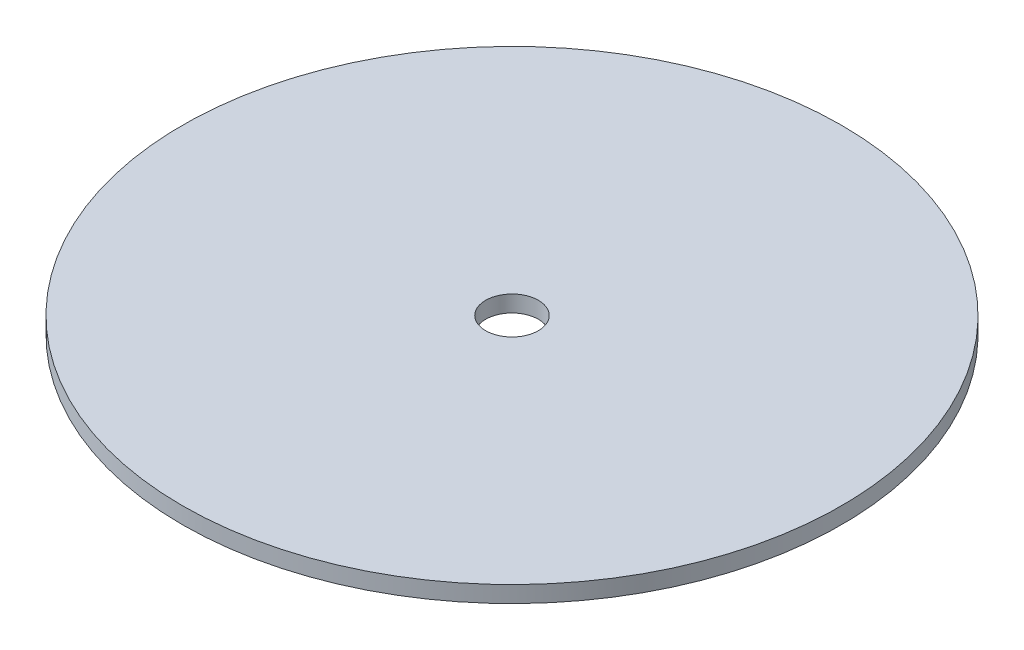
ISO-10303-21;
HEADER;
FILE_DESCRIPTION(('STEP AP214'),'2;1');
FILE_NAME('part.step','',(''),(''),'','','');
FILE_SCHEMA(('AUTOMOTIVE_DESIGN { 1 0 10303 214 1 1 1 1 }'));
ENDSEC;
DATA;
#1=APPLICATION_CONTEXT('core data for automotive mechanical design processes');
#2=APPLICATION_PROTOCOL_DEFINITION('international standard','automotive_design',2000,#1);
#3=PRODUCT_CONTEXT('',#1,'mechanical');
#4=PRODUCT('Part','Part','',(#3));
#5=PRODUCT_RELATED_PRODUCT_CATEGORY('part','',(#4));
#6=PRODUCT_DEFINITION_FORMATION('','',#4);
#7=PRODUCT_DEFINITION_CONTEXT('part definition',#1,'design');
#8=PRODUCT_DEFINITION('design','',#6,#7);
#9=PRODUCT_DEFINITION_SHAPE('','',#8);
#10=(LENGTH_UNIT() NAMED_UNIT(*) SI_UNIT(.MILLI.,.METRE.));
#11=(NAMED_UNIT(*) PLANE_ANGLE_UNIT() SI_UNIT($,.RADIAN.));
#12=(NAMED_UNIT(*) SI_UNIT($,.STERADIAN.) SOLID_ANGLE_UNIT());
#13=UNCERTAINTY_MEASURE_WITH_UNIT(LENGTH_MEASURE(1.E-05),#10,'distance_accuracy_value','');
#14=(GEOMETRIC_REPRESENTATION_CONTEXT(3) GLOBAL_UNCERTAINTY_ASSIGNED_CONTEXT((#13)) GLOBAL_UNIT_ASSIGNED_CONTEXT((#10,
#11,#12)) REPRESENTATION_CONTEXT('',''));
#15=CARTESIAN_POINT('',(0.,0.,0.));
#16=DIRECTION('',(0.,0.,1.));
#17=DIRECTION('',(1.,0.,0.));
#18=AXIS2_PLACEMENT_3D('',#15,#16,#17);
#19=CARTESIAN_POINT('',(729.999999999998,-22.4999999999992,1.55847557081751E-13));
#20=DIRECTION('',(0.,-1.,0.));
#21=DIRECTION('',(0.,0.,-1.));
#22=AXIS2_PLACEMENT_3D('',#19,#20,#21);
#23=PLANE('',#22);
#24=CARTESIAN_POINT('',(729.999999999998,-22.4999999999992,1.55847557081751E-13));
#25=DIRECTION('',(0.,-1.,0.));
#26=DIRECTION('',(0.,0.,-1.));
#27=AXIS2_PLACEMENT_3D('',#24,#25,#26);
#28=CIRCLE('',#27,100.);
#29=CARTESIAN_POINT('',(729.999999999998,-22.4999999999999,-99.9999999999999));
#30=VERTEX_POINT('',#29);
#31=EDGE_CURVE('E10',#30,#30,#28,.T.);
#32=ORIENTED_EDGE('',*,*,#31,.T.);
#33=EDGE_LOOP('',(#32));
#34=FACE_BOUND('',#33,.T.);
#35=CARTESIAN_POINT('',(729.999999999998,-22.4999999999992,1.55847557081751E-13));
#36=DIRECTION('',(0.,-1.,0.));
#37=DIRECTION('',(0.,0.,-1.));
#38=AXIS2_PLACEMENT_3D('',#35,#36,#37);
#39=CIRCLE('',#38,7.99999999999998);
#40=CARTESIAN_POINT('',(729.999999999998,-22.4999999999993,-7.99999999999983));
#41=VERTEX_POINT('',#40);
#42=EDGE_CURVE('E54',#41,#41,#39,.T.);
#43=ORIENTED_EDGE('',*,*,#42,.F.);
#44=EDGE_LOOP('',(#43));
#45=FACE_BOUND('',#44,.T.);
#46=ADVANCED_FACE('F40',(#34,#45),#23,.T.);
#47=CARTESIAN_POINT('',(729.999999999998,-17.4999999999992,1.21430643318371E-13));
#48=DIRECTION('',(0.,-1.,0.));
#49=DIRECTION('',(0.,0.,-1.));
#50=AXIS2_PLACEMENT_3D('',#47,#48,#49);
#51=PLANE('',#50);
#52=CARTESIAN_POINT('',(729.999999999998,-17.4999999999992,1.21430643318371E-13));
#53=DIRECTION('',(0.,-1.,0.));
#54=DIRECTION('',(0.,0.,-1.));
#55=AXIS2_PLACEMENT_3D('',#52,#53,#54);
#56=CIRCLE('',#55,100.);
#57=CARTESIAN_POINT('',(729.999999999998,-17.4999999999999,-99.9999999999999));
#58=VERTEX_POINT('',#57);
#59=EDGE_CURVE('E44',#58,#58,#56,.T.);
#60=ORIENTED_EDGE('',*,*,#59,.F.);
#61=EDGE_LOOP('',(#60));
#62=FACE_BOUND('',#61,.T.);
#63=CARTESIAN_POINT('',(729.999999999998,-17.4999999999992,1.21430643318371E-13));
#64=DIRECTION('',(0.,-1.,0.));
#65=DIRECTION('',(0.,0.,-1.));
#66=AXIS2_PLACEMENT_3D('',#63,#64,#65);
#67=CIRCLE('',#66,7.99999999999998);
#68=CARTESIAN_POINT('',(729.999999999998,-17.4999999999993,-7.99999999999986));
#69=VERTEX_POINT('',#68);
#70=EDGE_CURVE('E56',#69,#69,#67,.T.);
#71=ORIENTED_EDGE('',*,*,#70,.T.);
#72=EDGE_LOOP('',(#71));
#73=FACE_BOUND('',#72,.T.);
#74=ADVANCED_FACE('F69',(#62,#73),#51,.F.);
#75=CARTESIAN_POINT('',(729.999999999998,-22.4999999999992,1.55847557081751E-13));
#76=DIRECTION('',(0.,1.,0.));
#77=DIRECTION('',(0.,0.,1.));
#78=AXIS2_PLACEMENT_3D('',#75,#76,#77);
#79=CYLINDRICAL_SURFACE('',#78,100.);
#80=ORIENTED_EDGE('',*,*,#31,.F.);
#81=EDGE_LOOP('',(#80));
#82=FACE_BOUND('',#81,.T.);
#83=ORIENTED_EDGE('',*,*,#59,.T.);
#84=EDGE_LOOP('',(#83));
#85=FACE_BOUND('',#84,.T.);
#86=ADVANCED_FACE('F42',(#82,#85),#79,.T.);
#87=CARTESIAN_POINT('',(729.999999999998,-22.4999999999992,1.55847557081751E-13));
#88=DIRECTION('',(0.,1.,0.));
#89=DIRECTION('',(0.,0.,1.));
#90=AXIS2_PLACEMENT_3D('',#87,#88,#89);
#91=CYLINDRICAL_SURFACE('',#90,7.99999999999998);
#92=ORIENTED_EDGE('',*,*,#42,.T.);
#93=EDGE_LOOP('',(#92));
#94=FACE_BOUND('',#93,.T.);
#95=ORIENTED_EDGE('',*,*,#70,.F.);
#96=EDGE_LOOP('',(#95));
#97=FACE_BOUND('',#96,.T.);
#98=ADVANCED_FACE('F65',(#94,#97),#91,.F.);
#99=CLOSED_SHELL('',(#46,#74,#86,#98));
#100=MANIFOLD_SOLID_BREP('B2',#99);
#101=ADVANCED_BREP_SHAPE_REPRESENTATION('',(#18,#100),#14);
#102=SHAPE_DEFINITION_REPRESENTATION(#9,#101);
ENDSEC;
END-ISO-10303-21;
